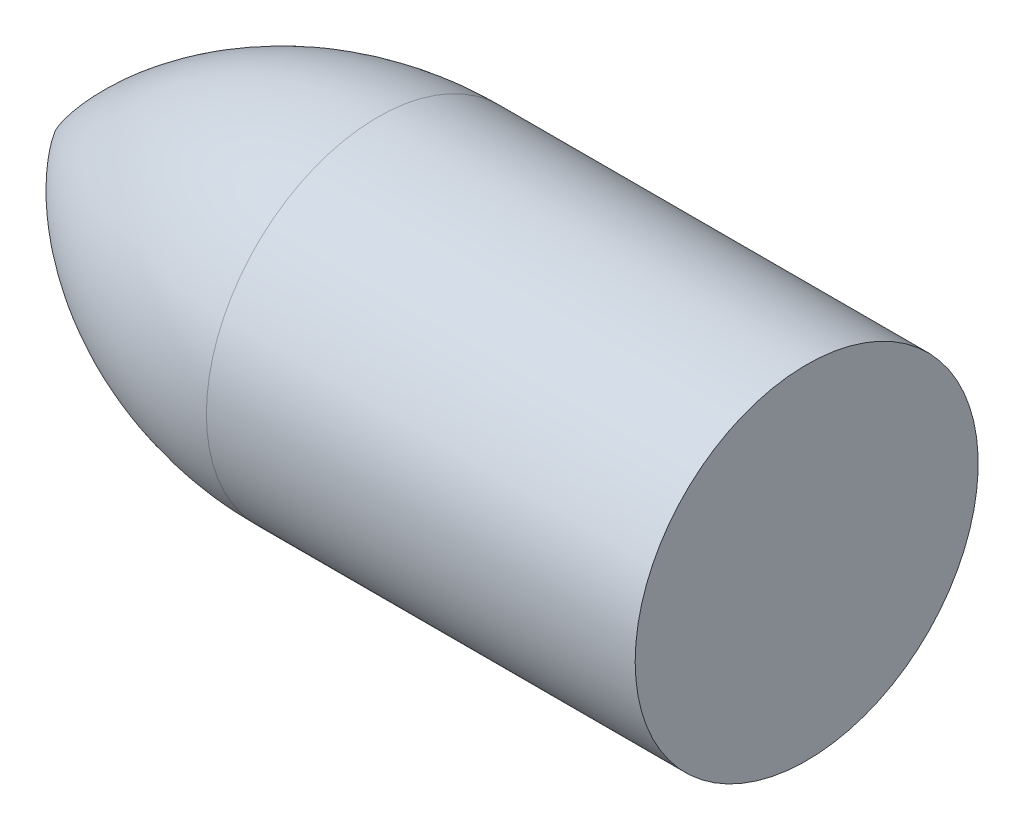
ISO-10303-21;
HEADER;
FILE_DESCRIPTION(('STEP AP214'),'2;1');
FILE_NAME('part.step','',(''),(''),'','','');
FILE_SCHEMA(('AUTOMOTIVE_DESIGN { 1 0 10303 214 1 1 1 1 }'));
ENDSEC;
DATA;
#1=APPLICATION_CONTEXT('core data for automotive mechanical design processes');
#2=APPLICATION_PROTOCOL_DEFINITION('international standard','automotive_design',2000,#1);
#3=PRODUCT_CONTEXT('',#1,'mechanical');
#4=PRODUCT('Part','Part','',(#3));
#5=PRODUCT_RELATED_PRODUCT_CATEGORY('part','',(#4));
#6=PRODUCT_DEFINITION_FORMATION('','',#4);
#7=PRODUCT_DEFINITION_CONTEXT('part definition',#1,'design');
#8=PRODUCT_DEFINITION('design','',#6,#7);
#9=PRODUCT_DEFINITION_SHAPE('','',#8);
#10=(LENGTH_UNIT() NAMED_UNIT(*) SI_UNIT(.MILLI.,.METRE.));
#11=(NAMED_UNIT(*) PLANE_ANGLE_UNIT() SI_UNIT($,.RADIAN.));
#12=(NAMED_UNIT(*) SI_UNIT($,.STERADIAN.) SOLID_ANGLE_UNIT());
#13=UNCERTAINTY_MEASURE_WITH_UNIT(LENGTH_MEASURE(1.E-05),#10,'distance_accuracy_value','');
#14=(GEOMETRIC_REPRESENTATION_CONTEXT(3) GLOBAL_UNCERTAINTY_ASSIGNED_CONTEXT((#13)) GLOBAL_UNIT_ASSIGNED_CONTEXT((#10,
#11,#12)) REPRESENTATION_CONTEXT('',''));
#15=CARTESIAN_POINT('',(0.,0.,0.));
#16=DIRECTION('',(0.,0.,1.));
#17=DIRECTION('',(1.,0.,0.));
#18=AXIS2_PLACEMENT_3D('',#15,#16,#17);
#19=CARTESIAN_POINT('',(150.,0.,-100.625));
#20=DIRECTION('',(0.,-1.,0.));
#21=DIRECTION('',(0.,0.,1.));
#22=AXIS2_PLACEMENT_3D('',#19,#20,#21);
#23=CIRCLE('',#22,180.625);
#24=TRIMMED_CURVE('',#23,(PARAMETER_VALUE(-0.979914652507456)),
(PARAMETER_VALUE(0.979914652507456)),.T.,.PARAMETER.);
#25=CARTESIAN_POINT('',(150.,0.,0.));
#26=DIRECTION('',(-1.,0.,0.));
#27=AXIS1_PLACEMENT('',#25,#26);
#28=SURFACE_OF_REVOLUTION('',#24,#27);
#29=CARTESIAN_POINT('',(0.,0.,0.));
#30=VERTEX_POINT('',#29);
#31=VERTEX_LOOP('',#30);
#32=FACE_BOUND('',#31,.T.);
#33=CARTESIAN_POINT('',(150.,0.,0.));
#34=DIRECTION('',(-1.,0.,0.));
#35=DIRECTION('',(0.,0.,1.));
#36=AXIS2_PLACEMENT_3D('',#33,#34,#35);
#37=CIRCLE('',#36,80.);
#38=CARTESIAN_POINT('',(150.,0.,80.));
#39=VERTEX_POINT('',#38);
#40=EDGE_CURVE('E44',#39,#39,#37,.T.);
#41=ORIENTED_EDGE('',*,*,#40,.T.);
#42=EDGE_LOOP('',(#41));
#43=FACE_BOUND('',#42,.T.);
#44=ADVANCED_FACE('F38',(#32,#43),#28,.T.);
#45=CARTESIAN_POINT('',(350.,0.,0.));
#46=DIRECTION('',(-1.,0.,0.));
#47=DIRECTION('',(0.,0.,1.));
#48=AXIS2_PLACEMENT_3D('',#45,#46,#47);
#49=PLANE('',#48);
#50=CARTESIAN_POINT('',(350.,0.,0.));
#51=DIRECTION('',(-1.,0.,0.));
#52=DIRECTION('',(0.,0.,1.));
#53=AXIS2_PLACEMENT_3D('',#50,#51,#52);
#54=CIRCLE('',#53,80.);
#55=CARTESIAN_POINT('',(350.,0.,80.));
#56=VERTEX_POINT('',#55);
#57=EDGE_CURVE('E11',#56,#56,#54,.T.);
#58=ORIENTED_EDGE('',*,*,#57,.F.);
#59=EDGE_LOOP('',(#58));
#60=FACE_BOUND('',#59,.T.);
#61=ADVANCED_FACE('F49',(#60),#49,.F.);
#62=CARTESIAN_POINT('',(0.,0.,0.));
#63=DIRECTION('',(-1.,0.,0.));
#64=DIRECTION('',(0.,0.,1.));
#65=AXIS2_PLACEMENT_3D('',#62,#63,#64);
#66=CYLINDRICAL_SURFACE('',#65,80.);
#67=ORIENTED_EDGE('',*,*,#40,.F.);
#68=EDGE_LOOP('',(#67));
#69=FACE_BOUND('',#68,.T.);
#70=ORIENTED_EDGE('',*,*,#57,.T.);
#71=EDGE_LOOP('',(#70));
#72=FACE_BOUND('',#71,.T.);
#73=ADVANCED_FACE('F53',(#69,#72),#66,.T.);
#74=CLOSED_SHELL('',(#44,#61,#73));
#75=MANIFOLD_SOLID_BREP('B2',#74);
#76=ADVANCED_BREP_SHAPE_REPRESENTATION('',(#18,#75),#14);
#77=SHAPE_DEFINITION_REPRESENTATION(#9,#76);
ENDSEC;
END-ISO-10303-21;
